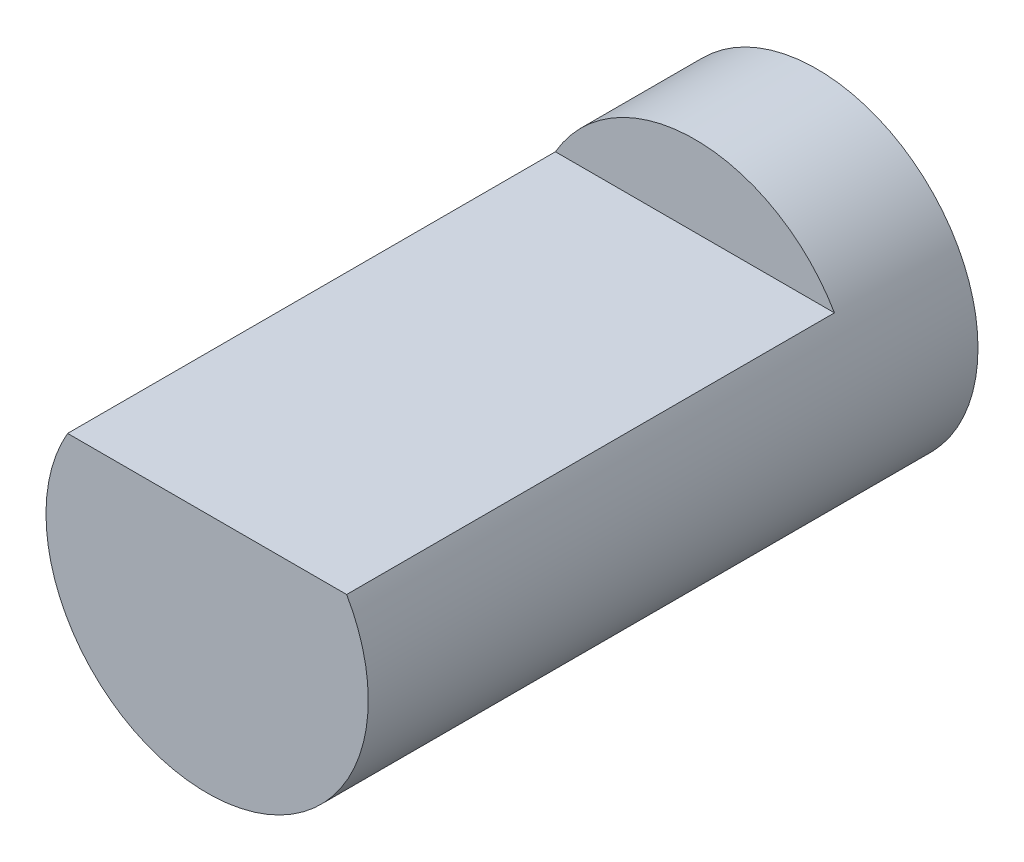
ISO-10303-21;
HEADER;
FILE_DESCRIPTION(('STEP AP214'),'2;1');
FILE_NAME('part.step','',(''),(''),'','','');
FILE_SCHEMA(('AUTOMOTIVE_DESIGN { 1 0 10303 214 1 1 1 1 }'));
ENDSEC;
DATA;
#1=APPLICATION_CONTEXT('core data for automotive mechanical design processes');
#2=APPLICATION_PROTOCOL_DEFINITION('international standard','automotive_design',2000,#1);
#3=PRODUCT_CONTEXT('',#1,'mechanical');
#4=PRODUCT('Part','Part','',(#3));
#5=PRODUCT_RELATED_PRODUCT_CATEGORY('part','',(#4));
#6=PRODUCT_DEFINITION_FORMATION('','',#4);
#7=PRODUCT_DEFINITION_CONTEXT('part definition',#1,'design');
#8=PRODUCT_DEFINITION('design','',#6,#7);
#9=PRODUCT_DEFINITION_SHAPE('','',#8);
#10=(LENGTH_UNIT() NAMED_UNIT(*) SI_UNIT(.MILLI.,.METRE.));
#11=(NAMED_UNIT(*) PLANE_ANGLE_UNIT() SI_UNIT($,.RADIAN.));
#12=(NAMED_UNIT(*) SI_UNIT($,.STERADIAN.) SOLID_ANGLE_UNIT());
#13=UNCERTAINTY_MEASURE_WITH_UNIT(LENGTH_MEASURE(1.E-05),#10,'distance_accuracy_value','');
#14=(GEOMETRIC_REPRESENTATION_CONTEXT(3) GLOBAL_UNCERTAINTY_ASSIGNED_CONTEXT((#13)) GLOBAL_UNIT_ASSIGNED_CONTEXT((#10,
#11,#12)) REPRESENTATION_CONTEXT('',''));
#15=CARTESIAN_POINT('',(0.,0.,0.));
#16=DIRECTION('',(0.,0.,1.));
#17=DIRECTION('',(1.,0.,0.));
#18=AXIS2_PLACEMENT_3D('',#15,#16,#17);
#19=CARTESIAN_POINT('',(0.,0.,20.));
#20=DIRECTION('',(0.,0.,-1.));
#21=DIRECTION('',(-1.,0.,0.));
#22=AXIS2_PLACEMENT_3D('',#19,#20,#21);
#23=CYLINDRICAL_SURFACE('',#22,5.28526040331796);
#24=CARTESIAN_POINT('',(0.,0.,20.));
#25=DIRECTION('',(0.,0.,1.));
#26=DIRECTION('',(1.,0.,0.));
#27=AXIS2_PLACEMENT_3D('',#24,#25,#26);
#28=CIRCLE('',#27,5.28526040331796);
#29=CARTESIAN_POINT('',(-4.57634590176412,2.64405667834249,20.));
#30=VERTEX_POINT('',#29);
#31=CARTESIAN_POINT('',(4.57634590176412,2.64405667834249,20.));
#32=VERTEX_POINT('',#31);
#33=EDGE_CURVE('E11',#30,#32,#28,.T.);
#34=ORIENTED_EDGE('',*,*,#33,.F.);
#35=DIRECTION('',(0.,0.,1.));
#36=VECTOR('',#35,1.);
#37=CARTESIAN_POINT('',(-4.57634590176411,2.64405667834249,4.));
#38=LINE('',#37,#36);
#39=CARTESIAN_POINT('',(-4.57634590176411,2.64405667834249,4.));
#40=VERTEX_POINT('',#39);
#41=EDGE_CURVE('E54',#40,#30,#38,.T.);
#42=ORIENTED_EDGE('',*,*,#41,.F.);
#43=CARTESIAN_POINT('',(0.,0.,4.));
#44=DIRECTION('',(0.,0.,1.));
#45=DIRECTION('',(1.,0.,0.));
#46=AXIS2_PLACEMENT_3D('',#43,#44,#45);
#47=CIRCLE('',#46,5.28526040331796);
#48=CARTESIAN_POINT('',(4.57634590176412,2.64405667834249,4.));
#49=VERTEX_POINT('',#48);
#50=EDGE_CURVE('E70',#49,#40,#47,.T.);
#51=ORIENTED_EDGE('',*,*,#50,.F.);
#52=DIRECTION('',(0.,0.,1.));
#53=VECTOR('',#52,1.);
#54=CARTESIAN_POINT('',(4.57634590176412,2.64405667834249,4.));
#55=LINE('',#54,#53);
#56=EDGE_CURVE('E60',#49,#32,#55,.T.);
#57=ORIENTED_EDGE('',*,*,#56,.T.);
#58=EDGE_LOOP('',(#34,#42,#51,#57));
#59=FACE_BOUND('',#58,.T.);
#60=CARTESIAN_POINT('',(0.,0.,0.));
#61=DIRECTION('',(0.,0.,1.));
#62=DIRECTION('',(1.,0.,0.));
#63=AXIS2_PLACEMENT_3D('',#60,#61,#62);
#64=CIRCLE('',#63,5.28526040331796);
#65=CARTESIAN_POINT('',(5.28526040331796,0.,0.));
#66=VERTEX_POINT('',#65);
#67=EDGE_CURVE('E42',#66,#66,#64,.T.);
#68=ORIENTED_EDGE('',*,*,#67,.T.);
#69=EDGE_LOOP('',(#68));
#70=FACE_BOUND('',#69,.T.);
#71=ADVANCED_FACE('F39',(#59,#70),#23,.T.);
#72=CARTESIAN_POINT('',(0.,0.,20.));
#73=DIRECTION('',(0.,0.,1.));
#74=DIRECTION('',(1.,0.,0.));
#75=AXIS2_PLACEMENT_3D('',#72,#73,#74);
#76=PLANE('',#75);
#77=DIRECTION('',(1.,0.,0.));
#78=VECTOR('',#77,1.);
#79=CARTESIAN_POINT('',(-4.57634590176411,2.64405667834249,20.));
#80=LINE('',#79,#78);
#81=EDGE_CURVE('E65',#30,#32,#80,.T.);
#82=ORIENTED_EDGE('',*,*,#81,.F.);
#83=ORIENTED_EDGE('',*,*,#33,.T.);
#84=EDGE_LOOP('',(#82,#83));
#85=FACE_BOUND('',#84,.T.);
#86=ADVANCED_FACE('F77',(#85),#76,.T.);
#87=CARTESIAN_POINT('',(0.,0.,0.));
#88=DIRECTION('',(0.,0.,1.));
#89=DIRECTION('',(1.,0.,0.));
#90=AXIS2_PLACEMENT_3D('',#87,#88,#89);
#91=PLANE('',#90);
#92=ORIENTED_EDGE('',*,*,#67,.F.);
#93=EDGE_LOOP('',(#92));
#94=FACE_BOUND('',#93,.T.);
#95=ADVANCED_FACE('F79',(#94),#91,.F.);
#96=CARTESIAN_POINT('',(-4.57634590176411,2.64405667834249,4.));
#97=DIRECTION('',(0.,-1.,0.));
#98=DIRECTION('',(0.,0.,-1.));
#99=AXIS2_PLACEMENT_3D('',#96,#97,#98);
#100=PLANE('',#99);
#101=ORIENTED_EDGE('',*,*,#81,.T.);
#102=ORIENTED_EDGE('',*,*,#56,.F.);
#103=DIRECTION('',(1.,0.,0.));
#104=VECTOR('',#103,1.);
#105=CARTESIAN_POINT('',(-4.57634590176411,2.64405667834249,4.));
#106=LINE('',#105,#104);
#107=EDGE_CURVE('E94',#40,#49,#106,.T.);
#108=ORIENTED_EDGE('',*,*,#107,.F.);
#109=ORIENTED_EDGE('',*,*,#41,.T.);
#110=EDGE_LOOP('',(#101,#102,#108,#109));
#111=FACE_BOUND('',#110,.T.);
#112=ADVANCED_FACE('F66',(#111),#100,.F.);
#113=CARTESIAN_POINT('',(0.,0.,4.));
#114=DIRECTION('',(0.,0.,1.));
#115=DIRECTION('',(1.,0.,0.));
#116=AXIS2_PLACEMENT_3D('',#113,#114,#115);
#117=PLANE('',#116);
#118=ORIENTED_EDGE('',*,*,#50,.T.);
#119=ORIENTED_EDGE('',*,*,#107,.T.);
#120=EDGE_LOOP('',(#118,#119));
#121=FACE_BOUND('',#120,.T.);
#122=ADVANCED_FACE('F89',(#121),#117,.T.);
#123=CLOSED_SHELL('',(#71,#86,#95,#112,#122));
#124=MANIFOLD_SOLID_BREP('B2',#123);
#125=ADVANCED_BREP_SHAPE_REPRESENTATION('',(#18,#124),#14);
#126=SHAPE_DEFINITION_REPRESENTATION(#9,#125);
ENDSEC;
END-ISO-10303-21;
